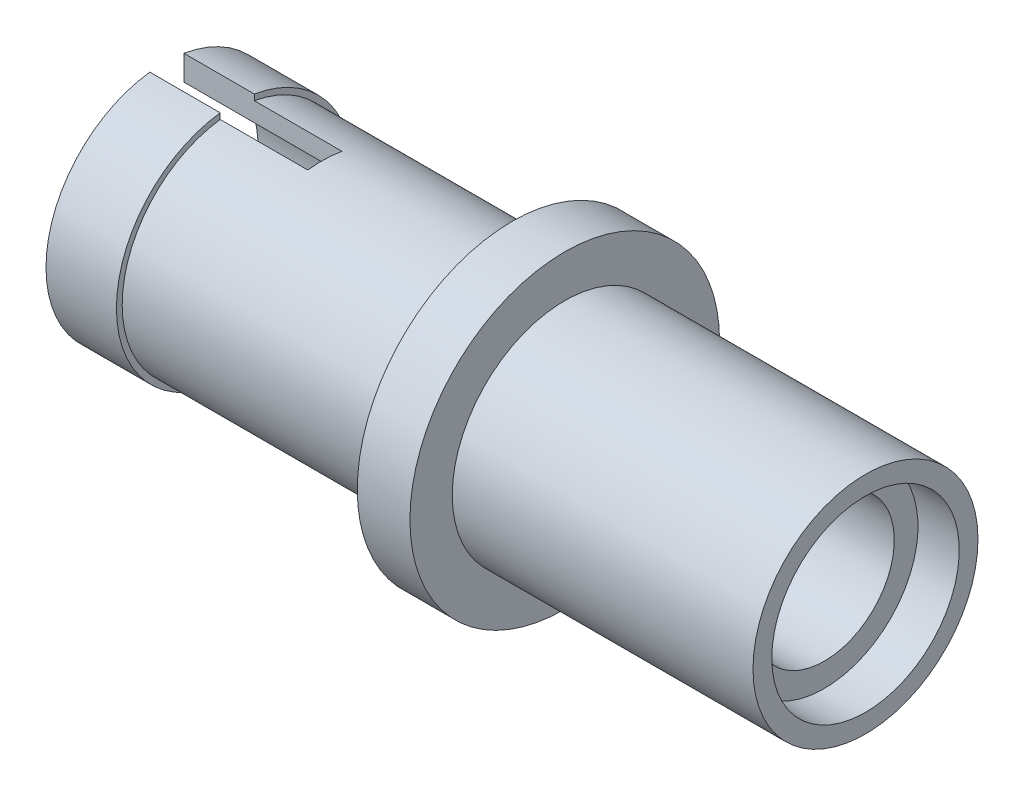
ISO-10303-21;
HEADER;
FILE_DESCRIPTION(('STEP AP214'),'2;1');
FILE_NAME('part.step','',(''),(''),'','','');
FILE_SCHEMA(('AUTOMOTIVE_DESIGN { 1 0 10303 214 1 1 1 1 }'));
ENDSEC;
DATA;
#1=APPLICATION_CONTEXT('core data for automotive mechanical design processes');
#2=APPLICATION_PROTOCOL_DEFINITION('international standard','automotive_design',2000,#1);
#3=PRODUCT_CONTEXT('',#1,'mechanical');
#4=PRODUCT('Part','Part','',(#3));
#5=PRODUCT_RELATED_PRODUCT_CATEGORY('part','',(#4));
#6=PRODUCT_DEFINITION_FORMATION('','',#4);
#7=PRODUCT_DEFINITION_CONTEXT('part definition',#1,'design');
#8=PRODUCT_DEFINITION('design','',#6,#7);
#9=PRODUCT_DEFINITION_SHAPE('','',#8);
#10=(LENGTH_UNIT() NAMED_UNIT(*) SI_UNIT(.MILLI.,.METRE.));
#11=(NAMED_UNIT(*) PLANE_ANGLE_UNIT() SI_UNIT($,.RADIAN.));
#12=(NAMED_UNIT(*) SI_UNIT($,.STERADIAN.) SOLID_ANGLE_UNIT());
#13=UNCERTAINTY_MEASURE_WITH_UNIT(LENGTH_MEASURE(1.E-05),#10,'distance_accuracy_value','');
#14=(GEOMETRIC_REPRESENTATION_CONTEXT(3) GLOBAL_UNCERTAINTY_ASSIGNED_CONTEXT((#13)) GLOBAL_UNIT_ASSIGNED_CONTEXT((#10,
#11,#12)) REPRESENTATION_CONTEXT('',''));
#15=CARTESIAN_POINT('',(0.,0.,0.));
#16=DIRECTION('',(0.,0.,1.));
#17=DIRECTION('',(1.,0.,0.));
#18=AXIS2_PLACEMENT_3D('',#15,#16,#17);
#19=CARTESIAN_POINT('',(-64.0463771494559,7.11496241209281,0.));
#20=DIRECTION('',(1.,0.,0.));
#21=DIRECTION('',(0.,0.,-1.));
#22=AXIS2_PLACEMENT_3D('',#19,#20,#21);
#23=PLANE('',#22);
#24=CARTESIAN_POINT('',(-64.0463771494559,4.10171487363888,0.));
#25=DIRECTION('',(-1.,0.,0.));
#26=DIRECTION('',(0.,0.,1.));
#27=AXIS2_PLACEMENT_3D('',#24,#25,#26);
#28=CIRCLE('',#27,3.80109757240897);
#29=CARTESIAN_POINT('',(-64.0463771494559,7.84996311273188,-0.631646968733));
#30=VERTEX_POINT('',#29);
#31=CARTESIAN_POINT('',(-64.0463771494559,0.353466634545878,-0.631646968733));
#32=VERTEX_POINT('',#31);
#33=EDGE_CURVE('E157',#30,#32,#28,.T.);
#34=ORIENTED_EDGE('',*,*,#33,.T.);
#35=DIRECTION('',(0.,-1.,0.));
#36=VECTOR('',#35,1.);
#37=CARTESIAN_POINT('',(-64.0463771494559,7.84996311273188,-0.631646968733));
#38=LINE('',#37,#36);
#39=CARTESIAN_POINT('',(-64.0463771494559,1.15541501875495,-0.631646968733));
#40=VERTEX_POINT('',#39);
#41=EDGE_CURVE('E150',#40,#32,#38,.T.);
#42=ORIENTED_EDGE('',*,*,#41,.F.);
#43=CARTESIAN_POINT('',(-64.0463771494559,4.10171487363888,0.));
#44=DIRECTION('',(-1.,0.,0.));
#45=DIRECTION('',(0.,0.,1.));
#46=AXIS2_PLACEMENT_3D('',#43,#44,#45);
#47=CIRCLE('',#46,3.01324753845393);
#48=CARTESIAN_POINT('',(-64.0463771494559,7.04801472852281,-0.631646968733));
#49=VERTEX_POINT('',#48);
#50=EDGE_CURVE('E200',#49,#40,#47,.T.);
#51=ORIENTED_EDGE('',*,*,#50,.F.);
#52=EDGE_CURVE('E194',#30,#49,#38,.T.);
#53=ORIENTED_EDGE('',*,*,#52,.F.);
#54=EDGE_LOOP('',(#34,#42,#51,#53));
#55=FACE_BOUND('',#54,.T.);
#56=ADVANCED_FACE('F39',(#55),#23,.F.);
#57=CARTESIAN_POINT('',(-52.8637455587399,4.10171487363888,0.));
#58=DIRECTION('',(-1.,0.,0.));
#59=DIRECTION('',(0.,0.,1.));
#60=AXIS2_PLACEMENT_3D('',#57,#58,#59);
#61=CYLINDRICAL_SURFACE('',#60,3.80109757240897);
#62=CARTESIAN_POINT('',(-61.7819371611859,4.10171487363888,0.));
#63=DIRECTION('',(-1.,0.,0.));
#64=DIRECTION('',(0.,0.,1.));
#65=AXIS2_PLACEMENT_3D('',#62,#63,#64);
#66=CIRCLE('',#65,3.80109757240897);
#67=CARTESIAN_POINT('',(-61.7819371611859,7.84996311273188,-0.631646968733));
#68=VERTEX_POINT('',#67);
#69=CARTESIAN_POINT('',(-61.7819371611859,0.353466634545878,-0.631646968733));
#70=VERTEX_POINT('',#69);
#71=EDGE_CURVE('E158',#68,#70,#66,.T.);
#72=ORIENTED_EDGE('',*,*,#71,.T.);
#73=DIRECTION('',(-1.,0.,0.));
#74=VECTOR('',#73,1.);
#75=CARTESIAN_POINT('',(-52.8637455587399,0.353466634545878,-0.631646968733));
#76=LINE('',#75,#74);
#77=EDGE_CURVE('E212',#70,#32,#76,.T.);
#78=ORIENTED_EDGE('',*,*,#77,.T.);
#79=ORIENTED_EDGE('',*,*,#33,.F.);
#80=DIRECTION('',(-1.,0.,0.));
#81=VECTOR('',#80,1.);
#82=CARTESIAN_POINT('',(-52.8637455587399,7.84996311273188,-0.631646968733));
#83=LINE('',#82,#81);
#84=EDGE_CURVE('E314',#30,#68,#83,.F.);
#85=ORIENTED_EDGE('',*,*,#84,.T.);
#86=EDGE_LOOP('',(#72,#78,#79,#85));
#87=FACE_BOUND('',#86,.T.);
#88=ADVANCED_FACE('F318',(#87),#61,.T.);
#89=CARTESIAN_POINT('',(-61.7819371611859,7.90281244604785,0.));
#90=DIRECTION('',(-1.,0.,0.));
#91=DIRECTION('',(0.,0.,1.));
#92=AXIS2_PLACEMENT_3D('',#89,#90,#91);
#93=PLANE('',#92);
#94=ORIENTED_EDGE('',*,*,#71,.F.);
#95=DIRECTION('',(0.,-1.,0.));
#96=VECTOR('',#95,1.);
#97=CARTESIAN_POINT('',(-61.7819371611859,7.90281244604785,-0.631646968733));
#98=LINE('',#97,#96);
#99=CARTESIAN_POINT('',(-61.7819371611859,7.66264710123113,-0.631646968733));
#100=VERTEX_POINT('',#99);
#101=EDGE_CURVE('E324',#68,#100,#98,.T.);
#102=ORIENTED_EDGE('',*,*,#101,.T.);
#103=CARTESIAN_POINT('',(-61.7819371611859,4.10171487363888,0.));
#104=DIRECTION('',(-1.,0.,0.));
#105=DIRECTION('',(0.,0.,1.));
#106=AXIS2_PLACEMENT_3D('',#103,#104,#105);
#107=CIRCLE('',#106,3.61651990491061);
#108=CARTESIAN_POINT('',(-61.7819371611859,0.54078264604663,-0.631646968733));
#109=VERTEX_POINT('',#108);
#110=EDGE_CURVE('E261',#100,#109,#107,.T.);
#111=ORIENTED_EDGE('',*,*,#110,.T.);
#112=EDGE_CURVE('E321',#109,#70,#98,.T.);
#113=ORIENTED_EDGE('',*,*,#112,.T.);
#114=EDGE_LOOP('',(#94,#102,#111,#113));
#115=FACE_BOUND('',#114,.T.);
#116=ADVANCED_FACE('F331',(#115),#93,.F.);
#117=CARTESIAN_POINT('',(-64.0463771494559,0.329109955012242,0.464537278296882));
#118=VERTEX_POINT('',#117);
#119=CARTESIAN_POINT('',(-64.0463771494559,7.87431979226551,0.464537278296882));
#120=VERTEX_POINT('',#119);
#121=EDGE_CURVE('E146',#118,#120,#28,.T.);
#122=ORIENTED_EDGE('',*,*,#121,.T.);
#123=DIRECTION('',(0.,1.,0.));
#124=VECTOR('',#123,1.);
#125=CARTESIAN_POINT('',(-64.0463771494559,8.21950283230422,0.464537278296882));
#126=LINE('',#125,#124);
#127=CARTESIAN_POINT('',(-64.0463771494559,7.0789393940725,0.464537278296882));
#128=VERTEX_POINT('',#127);
#129=EDGE_CURVE('E151',#128,#120,#126,.T.);
#130=ORIENTED_EDGE('',*,*,#129,.F.);
#131=CARTESIAN_POINT('',(-64.0463771494559,1.12449035320526,0.464537278296882));
#132=VERTEX_POINT('',#131);
#133=EDGE_CURVE('E148',#132,#128,#47,.T.);
#134=ORIENTED_EDGE('',*,*,#133,.F.);
#135=EDGE_CURVE('E131',#118,#132,#126,.T.);
#136=ORIENTED_EDGE('',*,*,#135,.F.);
#137=EDGE_LOOP('',(#122,#130,#134,#136));
#138=FACE_BOUND('',#137,.T.);
#139=ADVANCED_FACE('F41',(#138),#23,.F.);
#140=CARTESIAN_POINT('',(-61.7819371611859,0.329109955012242,0.464537278296882));
#141=VERTEX_POINT('',#140);
#142=CARTESIAN_POINT('',(-61.7819371611859,7.87431979226551,0.464537278296882));
#143=VERTEX_POINT('',#142);
#144=EDGE_CURVE('E165',#141,#143,#66,.T.);
#145=ORIENTED_EDGE('',*,*,#144,.T.);
#146=DIRECTION('',(-1.,0.,0.));
#147=VECTOR('',#146,1.);
#148=CARTESIAN_POINT('',(-52.8637455587399,7.87431979226551,0.464537278296882));
#149=LINE('',#148,#147);
#150=EDGE_CURVE('E155',#143,#120,#149,.T.);
#151=ORIENTED_EDGE('',*,*,#150,.T.);
#152=ORIENTED_EDGE('',*,*,#121,.F.);
#153=DIRECTION('',(-1.,0.,0.));
#154=VECTOR('',#153,1.);
#155=CARTESIAN_POINT('',(-58.9663771494559,0.329109955012242,0.464537278296882));
#156=LINE('',#155,#154);
#157=EDGE_CURVE('E128',#141,#118,#156,.T.);
#158=ORIENTED_EDGE('',*,*,#157,.F.);
#159=EDGE_LOOP('',(#145,#151,#152,#158));
#160=FACE_BOUND('',#159,.T.);
#161=ADVANCED_FACE('F154',(#160),#61,.T.);
#162=ORIENTED_EDGE('',*,*,#144,.F.);
#163=DIRECTION('',(0.,1.,0.));
#164=VECTOR('',#163,1.);
#165=CARTESIAN_POINT('',(-61.7819371611859,7.90281244604785,0.464537278296882));
#166=LINE('',#165,#164);
#167=CARTESIAN_POINT('',(-61.7819371611859,0.515153659929121,0.464537278296882));
#168=VERTEX_POINT('',#167);
#169=EDGE_CURVE('E134',#141,#168,#166,.T.);
#170=ORIENTED_EDGE('',*,*,#169,.T.);
#171=CARTESIAN_POINT('',(-61.7819371611859,7.68827608734863,0.464537278296882));
#172=VERTEX_POINT('',#171);
#173=EDGE_CURVE('E258',#168,#172,#107,.T.);
#174=ORIENTED_EDGE('',*,*,#173,.T.);
#175=EDGE_CURVE('E273',#172,#143,#166,.T.);
#176=ORIENTED_EDGE('',*,*,#175,.T.);
#177=EDGE_LOOP('',(#162,#170,#174,#176));
#178=FACE_BOUND('',#177,.T.);
#179=ADVANCED_FACE('F272',(#178),#93,.F.);
#180=CARTESIAN_POINT('',(-52.8637455587399,4.10171487363888,0.));
#181=DIRECTION('',(-1.,0.,0.));
#182=DIRECTION('',(0.,0.,1.));
#183=AXIS2_PLACEMENT_3D('',#180,#181,#182);
#184=CYLINDRICAL_SURFACE('',#183,3.61651990491061);
#185=ORIENTED_EDGE('',*,*,#110,.F.);
#186=DIRECTION('',(-1.,0.,0.));
#187=VECTOR('',#186,1.);
#188=CARTESIAN_POINT('',(-52.8637455587399,7.66264710123113,-0.631646968733));
#189=LINE('',#188,#187);
#190=CARTESIAN_POINT('',(-58.9663771494559,7.66264710123112,-0.631646968733));
#191=VERTEX_POINT('',#190);
#192=EDGE_CURVE('E281',#100,#191,#189,.F.);
#193=ORIENTED_EDGE('',*,*,#192,.T.);
#194=CARTESIAN_POINT('',(-58.9663771494559,4.10171487363888,0.));
#195=DIRECTION('',(-1.,0.,0.));
#196=DIRECTION('',(0.,0.,1.));
#197=AXIS2_PLACEMENT_3D('',#194,#195,#196);
#198=CIRCLE('',#197,3.61651990491061);
#199=CARTESIAN_POINT('',(-58.9663771494559,7.68827608734863,0.464537278296882));
#200=VERTEX_POINT('',#199);
#201=EDGE_CURVE('E289',#200,#191,#198,.T.);
#202=ORIENTED_EDGE('',*,*,#201,.F.);
#203=DIRECTION('',(-1.,0.,0.));
#204=VECTOR('',#203,1.);
#205=CARTESIAN_POINT('',(-52.8637455587399,7.68827608734863,0.464537278296882));
#206=LINE('',#205,#204);
#207=EDGE_CURVE('E277',#200,#172,#206,.T.);
#208=ORIENTED_EDGE('',*,*,#207,.T.);
#209=ORIENTED_EDGE('',*,*,#173,.F.);
#210=DIRECTION('',(-1.,0.,0.));
#211=VECTOR('',#210,1.);
#212=CARTESIAN_POINT('',(-52.8637455587399,0.515153659929121,0.464537278296882));
#213=LINE('',#212,#211);
#214=CARTESIAN_POINT('',(-58.9663771494559,0.515153659929122,0.464537278296882));
#215=VERTEX_POINT('',#214);
#216=EDGE_CURVE('E286',#168,#215,#213,.F.);
#217=ORIENTED_EDGE('',*,*,#216,.T.);
#218=CARTESIAN_POINT('',(-58.9663771494559,0.54078264604663,-0.631646968732999));
#219=VERTEX_POINT('',#218);
#220=EDGE_CURVE('E140',#219,#215,#198,.T.);
#221=ORIENTED_EDGE('',*,*,#220,.F.);
#222=DIRECTION('',(-1.,0.,0.));
#223=VECTOR('',#222,1.);
#224=CARTESIAN_POINT('',(-52.8637455587399,0.54078264604663,-0.631646968733));
#225=LINE('',#224,#223);
#226=EDGE_CURVE('E192',#219,#109,#225,.T.);
#227=ORIENTED_EDGE('',*,*,#226,.T.);
#228=EDGE_LOOP('',(#185,#193,#202,#208,#209,#217,#221,#227));
#229=FACE_BOUND('',#228,.T.);
#230=CARTESIAN_POINT('',(-52.8637455587399,4.10171487363888,0.));
#231=DIRECTION('',(-1.,0.,0.));
#232=DIRECTION('',(0.,0.,1.));
#233=AXIS2_PLACEMENT_3D('',#230,#231,#232);
#234=CIRCLE('',#233,3.61651990491061);
#235=CARTESIAN_POINT('',(-52.8637455587399,4.10171487363888,3.61651990491061));
#236=VERTEX_POINT('',#235);
#237=EDGE_CURVE('E255',#236,#236,#234,.T.);
#238=ORIENTED_EDGE('',*,*,#237,.T.);
#239=EDGE_LOOP('',(#238));
#240=FACE_BOUND('',#239,.T.);
#241=ADVANCED_FACE('F308',(#229,#240),#184,.T.);
#242=CARTESIAN_POINT('',(-52.8637455587399,9.07865999669362,0.));
#243=DIRECTION('',(1.,0.,0.));
#244=DIRECTION('',(0.,0.,-1.));
#245=AXIS2_PLACEMENT_3D('',#242,#243,#244);
#246=PLANE('',#245);
#247=ORIENTED_EDGE('',*,*,#237,.F.);
#248=EDGE_LOOP('',(#247));
#249=FACE_BOUND('',#248,.T.);
#250=CARTESIAN_POINT('',(-52.8637455587399,4.10171487363888,0.));
#251=DIRECTION('',(-1.,0.,0.));
#252=DIRECTION('',(0.,0.,1.));
#253=AXIS2_PLACEMENT_3D('',#250,#251,#252);
#254=CIRCLE('',#253,4.97694512305474);
#255=CARTESIAN_POINT('',(-52.8637455587399,4.10171487363888,4.97694512305474));
#256=VERTEX_POINT('',#255);
#257=EDGE_CURVE('E251',#256,#256,#254,.T.);
#258=ORIENTED_EDGE('',*,*,#257,.T.);
#259=EDGE_LOOP('',(#258));
#260=FACE_BOUND('',#259,.T.);
#261=ADVANCED_FACE('F382',(#249,#260),#246,.F.);
#262=CARTESIAN_POINT('',(-52.8637455587399,4.10171487363888,0.));
#263=DIRECTION('',(-1.,0.,0.));
#264=DIRECTION('',(0.,0.,1.));
#265=AXIS2_PLACEMENT_3D('',#262,#263,#264);
#266=CYLINDRICAL_SURFACE('',#265,4.97694512305474);
#267=ORIENTED_EDGE('',*,*,#257,.F.);
#268=EDGE_LOOP('',(#267));
#269=FACE_BOUND('',#268,.T.);
#270=CARTESIAN_POINT('',(-51.1708381042421,4.10171487363888,0.));
#271=DIRECTION('',(-1.,0.,0.));
#272=DIRECTION('',(0.,0.,1.));
#273=AXIS2_PLACEMENT_3D('',#270,#271,#272);
#274=CIRCLE('',#273,4.97694512305474);
#275=CARTESIAN_POINT('',(-51.1708381042421,4.10171487363888,4.97694512305474));
#276=VERTEX_POINT('',#275);
#277=EDGE_CURVE('E247',#276,#276,#274,.T.);
#278=ORIENTED_EDGE('',*,*,#277,.T.);
#279=EDGE_LOOP('',(#278));
#280=FACE_BOUND('',#279,.T.);
#281=ADVANCED_FACE('F485',(#269,#280),#266,.T.);
#282=CARTESIAN_POINT('',(-51.1708381042421,7.71823477854949,0.));
#283=DIRECTION('',(-1.,0.,0.));
#284=DIRECTION('',(0.,0.,1.));
#285=AXIS2_PLACEMENT_3D('',#282,#283,#284);
#286=PLANE('',#285);
#287=ORIENTED_EDGE('',*,*,#277,.F.);
#288=EDGE_LOOP('',(#287));
#289=FACE_BOUND('',#288,.T.);
#290=CARTESIAN_POINT('',(-51.1708381042421,4.10171487363888,0.));
#291=DIRECTION('',(-1.,0.,0.));
#292=DIRECTION('',(0.,0.,1.));
#293=AXIS2_PLACEMENT_3D('',#290,#291,#292);
#294=CIRCLE('',#293,3.61651990491061);
#295=CARTESIAN_POINT('',(-51.1708381042421,4.10171487363888,3.61651990491061));
#296=VERTEX_POINT('',#295);
#297=EDGE_CURVE('E243',#296,#296,#294,.T.);
#298=ORIENTED_EDGE('',*,*,#297,.T.);
#299=EDGE_LOOP('',(#298));
#300=FACE_BOUND('',#299,.T.);
#301=ADVANCED_FACE('F481',(#289,#300),#286,.F.);
#302=CARTESIAN_POINT('',(-52.8637455587399,4.10171487363888,0.));
#303=DIRECTION('',(-1.,0.,0.));
#304=DIRECTION('',(0.,0.,1.));
#305=AXIS2_PLACEMENT_3D('',#302,#303,#304);
#306=CYLINDRICAL_SURFACE('',#305,3.61651990491061);
#307=ORIENTED_EDGE('',*,*,#297,.F.);
#308=EDGE_LOOP('',(#307));
#309=FACE_BOUND('',#308,.T.);
#310=CARTESIAN_POINT('',(-41.5028585646464,4.10171487363888,0.));
#311=DIRECTION('',(-1.,0.,0.));
#312=DIRECTION('',(0.,0.,1.));
#313=AXIS2_PLACEMENT_3D('',#310,#311,#312);
#314=CIRCLE('',#313,3.61651990491061);
#315=CARTESIAN_POINT('',(-41.5028585646464,4.10171487363888,3.61651990491061));
#316=VERTEX_POINT('',#315);
#317=EDGE_CURVE('E239',#316,#316,#314,.T.);
#318=ORIENTED_EDGE('',*,*,#317,.T.);
#319=EDGE_LOOP('',(#318));
#320=FACE_BOUND('',#319,.T.);
#321=ADVANCED_FACE('F477',(#309,#320),#306,.T.);
#322=CARTESIAN_POINT('',(-41.5028585646464,7.11496241209281,0.));
#323=DIRECTION('',(-1.,0.,0.));
#324=DIRECTION('',(0.,0.,1.));
#325=AXIS2_PLACEMENT_3D('',#322,#323,#324);
#326=PLANE('',#325);
#327=ORIENTED_EDGE('',*,*,#317,.F.);
#328=EDGE_LOOP('',(#327));
#329=FACE_BOUND('',#328,.T.);
#330=CARTESIAN_POINT('',(-41.5028585646464,4.10171487363888,0.));
#331=DIRECTION('',(-1.,0.,0.));
#332=DIRECTION('',(0.,0.,1.));
#333=AXIS2_PLACEMENT_3D('',#330,#331,#332);
#334=CIRCLE('',#333,3.01324753845393);
#335=CARTESIAN_POINT('',(-41.5028585646464,4.10171487363888,3.01324753845393));
#336=VERTEX_POINT('',#335);
#337=EDGE_CURVE('E235',#336,#336,#334,.T.);
#338=ORIENTED_EDGE('',*,*,#337,.T.);
#339=EDGE_LOOP('',(#338));
#340=FACE_BOUND('',#339,.T.);
#341=ADVANCED_FACE('F473',(#329,#340),#326,.F.);
#342=CARTESIAN_POINT('',(-52.8637455587399,4.10171487363888,0.));
#343=DIRECTION('',(-1.,0.,0.));
#344=DIRECTION('',(0.,0.,1.));
#345=AXIS2_PLACEMENT_3D('',#342,#343,#344);
#346=CYLINDRICAL_SURFACE('',#345,3.01324753845393);
#347=ORIENTED_EDGE('',*,*,#337,.F.);
#348=EDGE_LOOP('',(#347));
#349=FACE_BOUND('',#348,.T.);
#350=CARTESIAN_POINT('',(-42.8284010848894,4.10171487363888,0.));
#351=DIRECTION('',(-1.,0.,0.));
#352=DIRECTION('',(0.,0.,1.));
#353=AXIS2_PLACEMENT_3D('',#350,#351,#352);
#354=CIRCLE('',#353,3.01324753845393);
#355=CARTESIAN_POINT('',(-42.8284010848894,4.10171487363888,3.01324753845393));
#356=VERTEX_POINT('',#355);
#357=EDGE_CURVE('E231',#356,#356,#354,.T.);
#358=ORIENTED_EDGE('',*,*,#357,.T.);
#359=EDGE_LOOP('',(#358));
#360=FACE_BOUND('',#359,.T.);
#361=ADVANCED_FACE('F469',(#349,#360),#346,.F.);
#362=CARTESIAN_POINT('',(-42.8284010848894,6.35296241209281,0.));
#363=DIRECTION('',(-1.,0.,0.));
#364=DIRECTION('',(0.,0.,1.));
#365=AXIS2_PLACEMENT_3D('',#362,#363,#364);
#366=PLANE('',#365);
#367=ORIENTED_EDGE('',*,*,#357,.F.);
#368=EDGE_LOOP('',(#367));
#369=FACE_BOUND('',#368,.T.);
#370=CARTESIAN_POINT('',(-42.8284010848894,4.10171487363888,0.));
#371=DIRECTION('',(-1.,0.,0.));
#372=DIRECTION('',(0.,0.,1.));
#373=AXIS2_PLACEMENT_3D('',#370,#371,#372);
#374=CIRCLE('',#373,2.25124753845393);
#375=CARTESIAN_POINT('',(-42.8284010848894,4.10171487363888,2.25124753845393));
#376=VERTEX_POINT('',#375);
#377=EDGE_CURVE('E227',#376,#376,#374,.T.);
#378=ORIENTED_EDGE('',*,*,#377,.T.);
#379=EDGE_LOOP('',(#378));
#380=FACE_BOUND('',#379,.T.);
#381=ADVANCED_FACE('F465',(#369,#380),#366,.F.);
#382=CARTESIAN_POINT('',(-52.8637455587399,4.10171487363888,0.));
#383=DIRECTION('',(-1.,0.,0.));
#384=DIRECTION('',(0.,0.,1.));
#385=AXIS2_PLACEMENT_3D('',#382,#383,#384);
#386=CYLINDRICAL_SURFACE('',#385,2.25124753845393);
#387=ORIENTED_EDGE('',*,*,#377,.F.);
#388=EDGE_LOOP('',(#387));
#389=FACE_BOUND('',#388,.T.);
#390=CARTESIAN_POINT('',(-51.1708381042421,4.10171487363888,0.));
#391=DIRECTION('',(-1.,0.,0.));
#392=DIRECTION('',(0.,0.,1.));
#393=AXIS2_PLACEMENT_3D('',#390,#391,#392);
#394=CIRCLE('',#393,2.25124753845393);
#395=CARTESIAN_POINT('',(-51.1708381042421,4.10171487363888,2.25124753845393));
#396=VERTEX_POINT('',#395);
#397=EDGE_CURVE('E223',#396,#396,#394,.T.);
#398=ORIENTED_EDGE('',*,*,#397,.T.);
#399=EDGE_LOOP('',(#398));
#400=FACE_BOUND('',#399,.T.);
#401=ADVANCED_FACE('F461',(#389,#400),#386,.F.);
#402=CARTESIAN_POINT('',(-51.1708381042421,4.10171487363888,0.));
#403=DIRECTION('',(-1.,0.,0.));
#404=DIRECTION('',(0.,0.,1.));
#405=AXIS2_PLACEMENT_3D('',#402,#403,#404);
#406=PLANE('',#405);
#407=ORIENTED_EDGE('',*,*,#397,.F.);
#408=EDGE_LOOP('',(#407));
#409=FACE_BOUND('',#408,.T.);
#410=ADVANCED_FACE('F457',(#409),#406,.F.);
#411=CARTESIAN_POINT('',(-52.8637455587399,6.35296241209281,0.));
#412=DIRECTION('',(1.,0.,0.));
#413=DIRECTION('',(0.,0.,-1.));
#414=AXIS2_PLACEMENT_3D('',#411,#412,#413);
#415=PLANE('',#414);
#416=CARTESIAN_POINT('',(-52.8637455587399,4.10171487363888,0.));
#417=DIRECTION('',(-1.,0.,0.));
#418=DIRECTION('',(0.,0.,1.));
#419=AXIS2_PLACEMENT_3D('',#416,#417,#418);
#420=CIRCLE('',#419,2.25124753845393);
#421=CARTESIAN_POINT('',(-52.8637455587399,4.10171487363888,2.25124753845393));
#422=VERTEX_POINT('',#421);
#423=EDGE_CURVE('E219',#422,#422,#420,.T.);
#424=ORIENTED_EDGE('',*,*,#423,.T.);
#425=EDGE_LOOP('',(#424));
#426=FACE_BOUND('',#425,.T.);
#427=ADVANCED_FACE('F453',(#426),#415,.F.);
#428=CARTESIAN_POINT('',(-52.8637455587399,4.10171487363888,0.));
#429=DIRECTION('',(-1.,0.,0.));
#430=DIRECTION('',(0.,0.,1.));
#431=AXIS2_PLACEMENT_3D('',#428,#429,#430);
#432=CYLINDRICAL_SURFACE('',#431,2.25124753845393);
#433=ORIENTED_EDGE('',*,*,#423,.F.);
#434=EDGE_LOOP('',(#433));
#435=FACE_BOUND('',#434,.T.);
#436=CARTESIAN_POINT('',(-57.649439031316,4.10171487363888,0.));
#437=DIRECTION('',(-1.,0.,0.));
#438=DIRECTION('',(0.,0.,1.));
#439=AXIS2_PLACEMENT_3D('',#436,#437,#438);
#440=CIRCLE('',#439,2.25124753845393);
#441=CARTESIAN_POINT('',(-57.649439031316,4.10171487363888,2.25124753845393));
#442=VERTEX_POINT('',#441);
#443=EDGE_CURVE('E210',#442,#442,#440,.T.);
#444=ORIENTED_EDGE('',*,*,#443,.T.);
#445=EDGE_LOOP('',(#444));
#446=FACE_BOUND('',#445,.T.);
#447=ADVANCED_FACE('F449',(#435,#446),#432,.F.);
#448=CARTESIAN_POINT('',(-57.649439031316,7.11496241209281,0.));
#449=DIRECTION('',(1.,0.,0.));
#450=DIRECTION('',(0.,0.,-1.));
#451=AXIS2_PLACEMENT_3D('',#448,#449,#450);
#452=PLANE('',#451);
#453=ORIENTED_EDGE('',*,*,#443,.F.);
#454=EDGE_LOOP('',(#453));
#455=FACE_BOUND('',#454,.T.);
#456=CARTESIAN_POINT('',(-57.649439031316,4.10171487363888,0.));
#457=DIRECTION('',(-1.,0.,0.));
#458=DIRECTION('',(0.,0.,1.));
#459=AXIS2_PLACEMENT_3D('',#456,#457,#458);
#460=CIRCLE('',#459,3.01324753845393);
#461=CARTESIAN_POINT('',(-57.649439031316,4.10171487363888,3.01324753845393));
#462=VERTEX_POINT('',#461);
#463=EDGE_CURVE('E205',#462,#462,#460,.T.);
#464=ORIENTED_EDGE('',*,*,#463,.T.);
#465=EDGE_LOOP('',(#464));
#466=FACE_BOUND('',#465,.T.);
#467=ADVANCED_FACE('F392',(#455,#466),#452,.F.);
#468=CARTESIAN_POINT('',(-52.8637455587399,4.10171487363888,0.));
#469=DIRECTION('',(-1.,0.,0.));
#470=DIRECTION('',(0.,0.,1.));
#471=AXIS2_PLACEMENT_3D('',#468,#469,#470);
#472=CYLINDRICAL_SURFACE('',#471,3.01324753845393);
#473=ORIENTED_EDGE('',*,*,#50,.T.);
#474=DIRECTION('',(-1.,0.,0.));
#475=VECTOR('',#474,1.);
#476=CARTESIAN_POINT('',(-52.8637455587399,1.15541501875495,-0.631646968733));
#477=LINE('',#476,#475);
#478=CARTESIAN_POINT('',(-58.9663771494559,1.15541501875495,-0.631646968732999));
#479=VERTEX_POINT('',#478);
#480=EDGE_CURVE('E11',#40,#479,#477,.F.);
#481=ORIENTED_EDGE('',*,*,#480,.T.);
#482=CARTESIAN_POINT('',(-58.9663771494559,4.10171487363888,0.));
#483=DIRECTION('',(-1.,0.,0.));
#484=DIRECTION('',(0.,0.,1.));
#485=AXIS2_PLACEMENT_3D('',#482,#483,#484);
#486=CIRCLE('',#485,3.01324753845393);
#487=CARTESIAN_POINT('',(-58.9663771494559,1.12449035320526,0.464537278296882));
#488=VERTEX_POINT('',#487);
#489=EDGE_CURVE('E172',#488,#479,#486,.F.);
#490=ORIENTED_EDGE('',*,*,#489,.F.);
#491=DIRECTION('',(-1.,0.,0.));
#492=VECTOR('',#491,1.);
#493=CARTESIAN_POINT('',(-52.8637455587399,1.12449035320526,0.464537278296882));
#494=LINE('',#493,#492);
#495=EDGE_CURVE('E48',#488,#132,#494,.T.);
#496=ORIENTED_EDGE('',*,*,#495,.T.);
#497=ORIENTED_EDGE('',*,*,#133,.T.);
#498=DIRECTION('',(-1.,0.,0.));
#499=VECTOR('',#498,1.);
#500=CARTESIAN_POINT('',(-52.8637455587399,7.0789393940725,0.464537278296882));
#501=LINE('',#500,#499);
#502=CARTESIAN_POINT('',(-58.9663771494559,7.0789393940725,0.464537278296882));
#503=VERTEX_POINT('',#502);
#504=EDGE_CURVE('E171',#128,#503,#501,.F.);
#505=ORIENTED_EDGE('',*,*,#504,.T.);
#506=CARTESIAN_POINT('',(-58.9663771494559,7.04801472852281,-0.631646968733));
#507=VERTEX_POINT('',#506);
#508=EDGE_CURVE('E163',#507,#503,#486,.F.);
#509=ORIENTED_EDGE('',*,*,#508,.F.);
#510=DIRECTION('',(-1.,0.,0.));
#511=VECTOR('',#510,1.);
#512=CARTESIAN_POINT('',(-52.8637455587399,7.04801472852281,-0.631646968733));
#513=LINE('',#512,#511);
#514=EDGE_CURVE('E176',#507,#49,#513,.T.);
#515=ORIENTED_EDGE('',*,*,#514,.T.);
#516=EDGE_LOOP('',(#473,#481,#490,#496,#497,#505,#509,#515));
#517=FACE_BOUND('',#516,.T.);
#518=ORIENTED_EDGE('',*,*,#463,.F.);
#519=EDGE_LOOP('',(#518));
#520=FACE_BOUND('',#519,.T.);
#521=ADVANCED_FACE('F197',(#517,#520),#472,.F.);
#522=CARTESIAN_POINT('',(-58.9663771494559,0.,0.));
#523=DIRECTION('',(-1.,0.,0.));
#524=DIRECTION('',(0.,0.,1.));
#525=AXIS2_PLACEMENT_3D('',#522,#523,#524);
#526=PLANE('',#525);
#527=ORIENTED_EDGE('',*,*,#201,.T.);
#528=DIRECTION('',(0.,-1.,0.));
#529=VECTOR('',#528,1.);
#530=CARTESIAN_POINT('',(-58.9663771494559,7.84996311273188,-0.631646968733));
#531=LINE('',#530,#529);
#532=EDGE_CURVE('E63',#191,#507,#531,.T.);
#533=ORIENTED_EDGE('',*,*,#532,.T.);
#534=ORIENTED_EDGE('',*,*,#508,.T.);
#535=DIRECTION('',(0.,1.,0.));
#536=VECTOR('',#535,1.);
#537=CARTESIAN_POINT('',(-58.9663771494559,7.84996311273188,0.464537278296882));
#538=LINE('',#537,#536);
#539=EDGE_CURVE('E297',#503,#200,#538,.T.);
#540=ORIENTED_EDGE('',*,*,#539,.T.);
#541=EDGE_LOOP('',(#527,#533,#534,#540));
#542=FACE_BOUND('',#541,.T.);
#543=ADVANCED_FACE('F307',(#542),#526,.T.);
#544=CARTESIAN_POINT('',(-58.9663771494559,8.21950283230422,0.464537278296882));
#545=DIRECTION('',(0.,0.,1.));
#546=DIRECTION('',(1.,0.,0.));
#547=AXIS2_PLACEMENT_3D('',#544,#545,#546);
#548=PLANE('',#547);
#549=ORIENTED_EDGE('',*,*,#175,.F.);
#550=ORIENTED_EDGE('',*,*,#207,.F.);
#551=ORIENTED_EDGE('',*,*,#539,.F.);
#552=ORIENTED_EDGE('',*,*,#504,.F.);
#553=ORIENTED_EDGE('',*,*,#129,.T.);
#554=ORIENTED_EDGE('',*,*,#150,.F.);
#555=EDGE_LOOP('',(#549,#550,#551,#552,#553,#554));
#556=FACE_BOUND('',#555,.T.);
#557=ADVANCED_FACE('F306',(#556),#548,.F.);
#558=CARTESIAN_POINT('',(-58.9663771494559,7.84996311273188,-0.631646968733));
#559=DIRECTION('',(0.,0.,-1.));
#560=DIRECTION('',(-1.,0.,0.));
#561=AXIS2_PLACEMENT_3D('',#558,#559,#560);
#562=PLANE('',#561);
#563=ORIENTED_EDGE('',*,*,#52,.T.);
#564=ORIENTED_EDGE('',*,*,#514,.F.);
#565=ORIENTED_EDGE('',*,*,#532,.F.);
#566=ORIENTED_EDGE('',*,*,#192,.F.);
#567=ORIENTED_EDGE('',*,*,#101,.F.);
#568=ORIENTED_EDGE('',*,*,#84,.F.);
#569=EDGE_LOOP('',(#563,#564,#565,#566,#567,#568));
#570=FACE_BOUND('',#569,.T.);
#571=ADVANCED_FACE('F312',(#570),#562,.F.);
#572=ORIENTED_EDGE('',*,*,#112,.F.);
#573=ORIENTED_EDGE('',*,*,#226,.F.);
#574=EDGE_CURVE('E186',#479,#219,#531,.T.);
#575=ORIENTED_EDGE('',*,*,#574,.F.);
#576=ORIENTED_EDGE('',*,*,#480,.F.);
#577=ORIENTED_EDGE('',*,*,#41,.T.);
#578=ORIENTED_EDGE('',*,*,#77,.F.);
#579=EDGE_LOOP('',(#572,#573,#575,#576,#577,#578));
#580=FACE_BOUND('',#579,.T.);
#581=ADVANCED_FACE('F189',(#580),#562,.F.);
#582=ORIENTED_EDGE('',*,*,#157,.T.);
#583=ORIENTED_EDGE('',*,*,#135,.T.);
#584=ORIENTED_EDGE('',*,*,#495,.F.);
#585=EDGE_CURVE('E55',#215,#488,#538,.T.);
#586=ORIENTED_EDGE('',*,*,#585,.F.);
#587=ORIENTED_EDGE('',*,*,#216,.F.);
#588=ORIENTED_EDGE('',*,*,#169,.F.);
#589=EDGE_LOOP('',(#582,#583,#584,#586,#587,#588));
#590=FACE_BOUND('',#589,.T.);
#591=ADVANCED_FACE('F130',(#590),#548,.F.);
#592=ORIENTED_EDGE('',*,*,#220,.T.);
#593=ORIENTED_EDGE('',*,*,#585,.T.);
#594=ORIENTED_EDGE('',*,*,#489,.T.);
#595=ORIENTED_EDGE('',*,*,#574,.T.);
#596=EDGE_LOOP('',(#592,#593,#594,#595));
#597=FACE_BOUND('',#596,.T.);
#598=ADVANCED_FACE('F185',(#597),#526,.T.);
#599=CLOSED_SHELL('',(#56,#88,#116,#139,#161,#179,#241,#261,#281,#301,#321,#341,#361,#381,#401,
#410,#427,#447,#467,#521,#543,#557,#571,#581,#591,#598));
#600=MANIFOLD_SOLID_BREP('B2',#599);
#601=ADVANCED_BREP_SHAPE_REPRESENTATION('',(#18,#600),#14);
#602=SHAPE_DEFINITION_REPRESENTATION(#9,#601);
ENDSEC;
END-ISO-10303-21;
